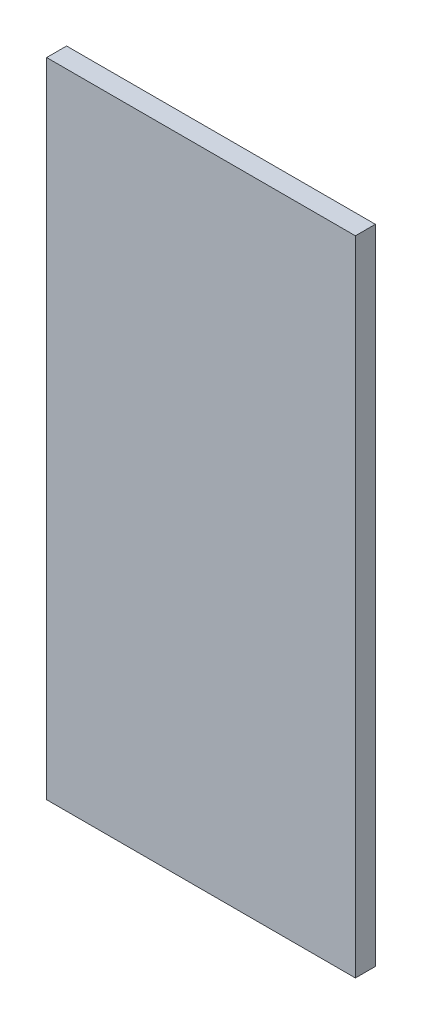
ISO-10303-21;
HEADER;
FILE_DESCRIPTION(('STEP AP214'),'2;1');
FILE_NAME('part.step','',(''),(''),'','','');
FILE_SCHEMA(('AUTOMOTIVE_DESIGN { 1 0 10303 214 1 1 1 1 }'));
ENDSEC;
DATA;
#1=APPLICATION_CONTEXT('core data for automotive mechanical design processes');
#2=APPLICATION_PROTOCOL_DEFINITION('international standard','automotive_design',2000,#1);
#3=PRODUCT_CONTEXT('',#1,'mechanical');
#4=PRODUCT('Part','Part','',(#3));
#5=PRODUCT_RELATED_PRODUCT_CATEGORY('part','',(#4));
#6=PRODUCT_DEFINITION_FORMATION('','',#4);
#7=PRODUCT_DEFINITION_CONTEXT('part definition',#1,'design');
#8=PRODUCT_DEFINITION('design','',#6,#7);
#9=PRODUCT_DEFINITION_SHAPE('','',#8);
#10=(LENGTH_UNIT() NAMED_UNIT(*) SI_UNIT(.MILLI.,.METRE.));
#11=(NAMED_UNIT(*) PLANE_ANGLE_UNIT() SI_UNIT($,.RADIAN.));
#12=(NAMED_UNIT(*) SI_UNIT($,.STERADIAN.) SOLID_ANGLE_UNIT());
#13=UNCERTAINTY_MEASURE_WITH_UNIT(LENGTH_MEASURE(1.E-05),#10,'distance_accuracy_value','');
#14=(GEOMETRIC_REPRESENTATION_CONTEXT(3) GLOBAL_UNCERTAINTY_ASSIGNED_CONTEXT((#13)) GLOBAL_UNIT_ASSIGNED_CONTEXT((#10,
#11,#12)) REPRESENTATION_CONTEXT('',''));
#15=CARTESIAN_POINT('',(0.,0.,0.));
#16=DIRECTION('',(0.,0.,1.));
#17=DIRECTION('',(1.,0.,0.));
#18=AXIS2_PLACEMENT_3D('',#15,#16,#17);
#19=CARTESIAN_POINT('',(91.0419998168945,100.66300201416,0.));
#20=DIRECTION('',(1.,0.,0.));
#21=DIRECTION('',(0.,-1.,0.));
#22=AXIS2_PLACEMENT_3D('',#19,#20,#21);
#23=PLANE('',#22);
#24=DIRECTION('',(0.,-1.,0.));
#25=VECTOR('',#24,1.);
#26=CARTESIAN_POINT('',(91.0419998168945,100.66300201416,0.03556));
#27=LINE('',#26,#25);
#28=CARTESIAN_POINT('',(91.0419998168945,100.66300201416,0.03556));
#29=VERTEX_POINT('',#28);
#30=CARTESIAN_POINT('',(91.0419998168945,99.5179977416992,0.03556));
#31=VERTEX_POINT('',#30);
#32=EDGE_CURVE('E11',#29,#31,#27,.T.);
#33=ORIENTED_EDGE('',*,*,#32,.F.);
#34=DIRECTION('',(0.,0.,1.));
#35=VECTOR('',#34,1.);
#36=CARTESIAN_POINT('',(91.0419998168945,100.66300201416,0.));
#37=LINE('',#36,#35);
#38=CARTESIAN_POINT('',(91.0419998168945,100.66300201416,0.));
#39=VERTEX_POINT('',#38);
#40=EDGE_CURVE('E24',#39,#29,#37,.T.);
#41=ORIENTED_EDGE('',*,*,#40,.F.);
#42=DIRECTION('',(0.,-1.,0.));
#43=VECTOR('',#42,1.);
#44=CARTESIAN_POINT('',(91.0419998168945,100.66300201416,0.));
#45=LINE('',#44,#43);
#46=CARTESIAN_POINT('',(91.0419998168945,99.5179977416992,0.));
#47=VERTEX_POINT('',#46);
#48=EDGE_CURVE('E75',#39,#47,#45,.T.);
#49=ORIENTED_EDGE('',*,*,#48,.T.);
#50=DIRECTION('',(0.,0.,1.));
#51=VECTOR('',#50,1.);
#52=CARTESIAN_POINT('',(91.0419998168945,99.5179977416992,0.));
#53=LINE('',#52,#51);
#54=EDGE_CURVE('E37',#47,#31,#53,.T.);
#55=ORIENTED_EDGE('',*,*,#54,.T.);
#56=EDGE_LOOP('',(#33,#41,#49,#55));
#57=FACE_BOUND('',#56,.T.);
#58=ADVANCED_FACE('F17',(#57),#23,.F.);
#59=CARTESIAN_POINT('',(91.0419998168945,99.5179977416992,0.));
#60=DIRECTION('',(0.,1.,0.));
#61=DIRECTION('',(1.,0.,0.));
#62=AXIS2_PLACEMENT_3D('',#59,#60,#61);
#63=PLANE('',#62);
#64=DIRECTION('',(1.,0.,0.));
#65=VECTOR('',#64,1.);
#66=CARTESIAN_POINT('',(91.0419998168945,99.5179977416992,0.03556));
#67=LINE('',#66,#65);
#68=CARTESIAN_POINT('',(91.5920028686523,99.5179977416992,0.03556));
#69=VERTEX_POINT('',#68);
#70=EDGE_CURVE('E83',#31,#69,#67,.T.);
#71=ORIENTED_EDGE('',*,*,#70,.F.);
#72=ORIENTED_EDGE('',*,*,#54,.F.);
#73=DIRECTION('',(1.,0.,0.));
#74=VECTOR('',#73,1.);
#75=CARTESIAN_POINT('',(91.0419998168945,99.5179977416992,0.));
#76=LINE('',#75,#74);
#77=CARTESIAN_POINT('',(91.5920028686523,99.5179977416992,0.));
#78=VERTEX_POINT('',#77);
#79=EDGE_CURVE('E81',#47,#78,#76,.T.);
#80=ORIENTED_EDGE('',*,*,#79,.T.);
#81=DIRECTION('',(0.,0.,1.));
#82=VECTOR('',#81,1.);
#83=CARTESIAN_POINT('',(91.5920028686523,99.5179977416992,0.));
#84=LINE('',#83,#82);
#85=EDGE_CURVE('E67',#78,#69,#84,.T.);
#86=ORIENTED_EDGE('',*,*,#85,.T.);
#87=EDGE_LOOP('',(#71,#72,#80,#86));
#88=FACE_BOUND('',#87,.T.);
#89=ADVANCED_FACE('F89',(#88),#63,.F.);
#90=CARTESIAN_POINT('',(91.5920028686523,99.5179977416992,0.));
#91=DIRECTION('',(-1.,0.,0.));
#92=DIRECTION('',(0.,1.,0.));
#93=AXIS2_PLACEMENT_3D('',#90,#91,#92);
#94=PLANE('',#93);
#95=DIRECTION('',(0.,1.,0.));
#96=VECTOR('',#95,1.);
#97=CARTESIAN_POINT('',(91.5920028686523,99.5179977416992,0.03556));
#98=LINE('',#97,#96);
#99=CARTESIAN_POINT('',(91.5920028686523,100.66300201416,0.03556));
#100=VERTEX_POINT('',#99);
#101=EDGE_CURVE('E71',#69,#100,#98,.T.);
#102=ORIENTED_EDGE('',*,*,#101,.F.);
#103=ORIENTED_EDGE('',*,*,#85,.F.);
#104=DIRECTION('',(0.,1.,0.));
#105=VECTOR('',#104,1.);
#106=CARTESIAN_POINT('',(91.5920028686523,99.5179977416992,0.));
#107=LINE('',#106,#105);
#108=CARTESIAN_POINT('',(91.5920028686523,100.66300201416,0.));
#109=VERTEX_POINT('',#108);
#110=EDGE_CURVE('E63',#78,#109,#107,.T.);
#111=ORIENTED_EDGE('',*,*,#110,.T.);
#112=DIRECTION('',(0.,0.,1.));
#113=VECTOR('',#112,1.);
#114=CARTESIAN_POINT('',(91.5920028686523,100.66300201416,0.));
#115=LINE('',#114,#113);
#116=EDGE_CURVE('E53',#109,#100,#115,.T.);
#117=ORIENTED_EDGE('',*,*,#116,.T.);
#118=EDGE_LOOP('',(#102,#103,#111,#117));
#119=FACE_BOUND('',#118,.T.);
#120=ADVANCED_FACE('F66',(#119),#94,.F.);
#121=CARTESIAN_POINT('',(91.5920028686523,100.66300201416,0.));
#122=DIRECTION('',(0.,-1.,0.));
#123=DIRECTION('',(-1.,0.,0.));
#124=AXIS2_PLACEMENT_3D('',#121,#122,#123);
#125=PLANE('',#124);
#126=DIRECTION('',(-1.,0.,0.));
#127=VECTOR('',#126,1.);
#128=CARTESIAN_POINT('',(91.5920028686523,100.66300201416,0.03556));
#129=LINE('',#128,#127);
#130=EDGE_CURVE('E59',#100,#29,#129,.T.);
#131=ORIENTED_EDGE('',*,*,#130,.F.);
#132=ORIENTED_EDGE('',*,*,#116,.F.);
#133=DIRECTION('',(-1.,0.,0.));
#134=VECTOR('',#133,1.);
#135=CARTESIAN_POINT('',(91.5920028686523,100.66300201416,0.));
#136=LINE('',#135,#134);
#137=EDGE_CURVE('E57',#109,#39,#136,.T.);
#138=ORIENTED_EDGE('',*,*,#137,.T.);
#139=ORIENTED_EDGE('',*,*,#40,.T.);
#140=EDGE_LOOP('',(#131,#132,#138,#139));
#141=FACE_BOUND('',#140,.T.);
#142=ADVANCED_FACE('F55',(#141),#125,.F.);
#143=CARTESIAN_POINT('',(91.0419998168945,100.66300201416,0.));
#144=DIRECTION('',(0.,0.,-1.));
#145=DIRECTION('',(-1.,0.,0.));
#146=AXIS2_PLACEMENT_3D('',#143,#144,#145);
#147=PLANE('',#146);
#148=ORIENTED_EDGE('',*,*,#137,.F.);
#149=ORIENTED_EDGE('',*,*,#110,.F.);
#150=ORIENTED_EDGE('',*,*,#79,.F.);
#151=ORIENTED_EDGE('',*,*,#48,.F.);
#152=EDGE_LOOP('',(#148,#149,#150,#151));
#153=FACE_BOUND('',#152,.T.);
#154=ADVANCED_FACE('F74',(#153),#147,.T.);
#155=CARTESIAN_POINT('',(91.0419998168945,100.66300201416,0.03556));
#156=DIRECTION('',(0.,0.,-1.));
#157=DIRECTION('',(-1.,0.,0.));
#158=AXIS2_PLACEMENT_3D('',#155,#156,#157);
#159=PLANE('',#158);
#160=ORIENTED_EDGE('',*,*,#32,.T.);
#161=ORIENTED_EDGE('',*,*,#70,.T.);
#162=ORIENTED_EDGE('',*,*,#101,.T.);
#163=ORIENTED_EDGE('',*,*,#130,.T.);
#164=EDGE_LOOP('',(#160,#161,#162,#163));
#165=FACE_BOUND('',#164,.T.);
#166=ADVANCED_FACE('F91',(#165),#159,.F.);
#167=CLOSED_SHELL('',(#58,#89,#120,#142,#154,#166));
#168=MANIFOLD_SOLID_BREP('B1',#167);
#169=ADVANCED_BREP_SHAPE_REPRESENTATION('',(#18,#168),#14);
#170=SHAPE_DEFINITION_REPRESENTATION(#9,#169);
ENDSEC;
END-ISO-10303-21;
